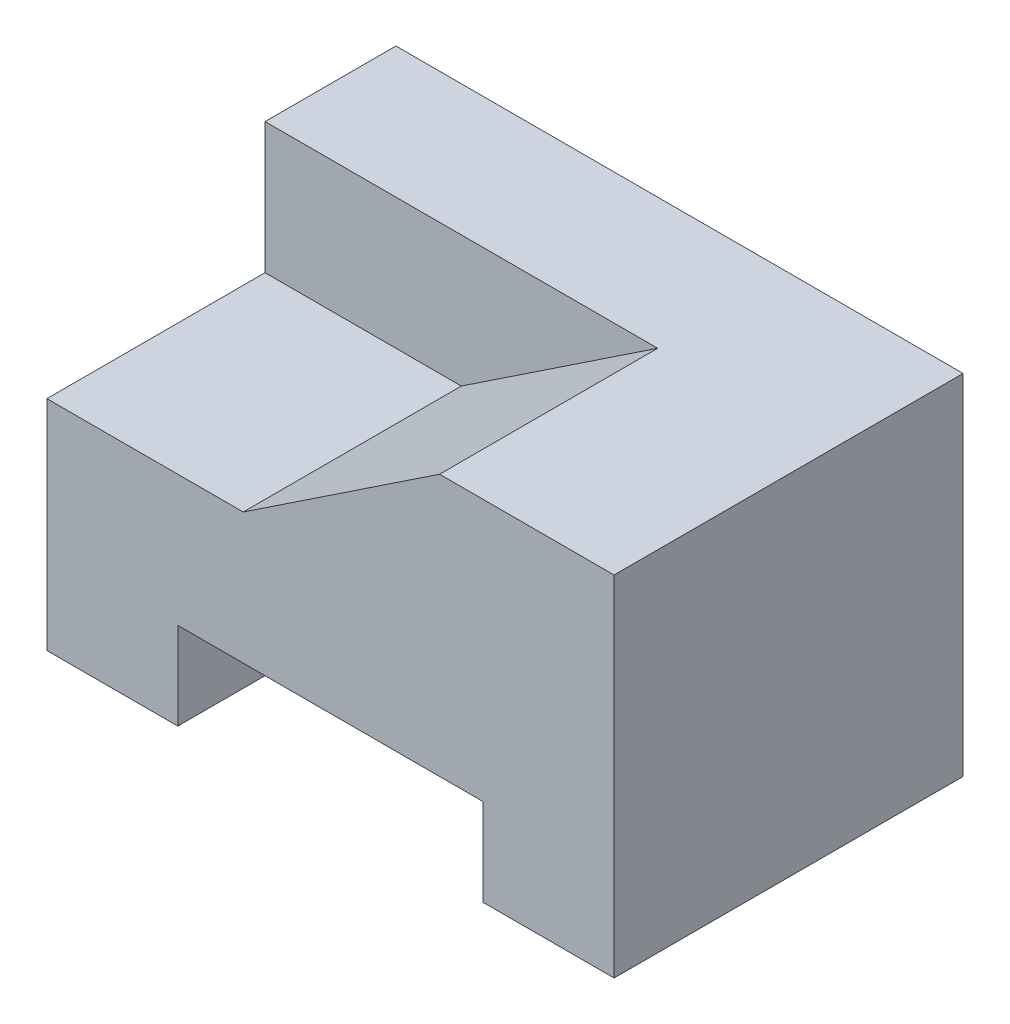
ISO-10303-21;
HEADER;
FILE_DESCRIPTION(('STEP AP214'),'2;1');
FILE_NAME('part.step','',(''),(''),'','','');
FILE_SCHEMA(('AUTOMOTIVE_DESIGN { 1 0 10303 214 1 1 1 1 }'));
ENDSEC;
DATA;
#1=APPLICATION_CONTEXT('core data for automotive mechanical design processes');
#2=APPLICATION_PROTOCOL_DEFINITION('international standard','automotive_design',2000,#1);
#3=PRODUCT_CONTEXT('',#1,'mechanical');
#4=PRODUCT('Part','Part','',(#3));
#5=PRODUCT_RELATED_PRODUCT_CATEGORY('part','',(#4));
#6=PRODUCT_DEFINITION_FORMATION('','',#4);
#7=PRODUCT_DEFINITION_CONTEXT('part definition',#1,'design');
#8=PRODUCT_DEFINITION('design','',#6,#7);
#9=PRODUCT_DEFINITION_SHAPE('','',#8);
#10=(LENGTH_UNIT() NAMED_UNIT(*) SI_UNIT(.MILLI.,.METRE.));
#11=(NAMED_UNIT(*) PLANE_ANGLE_UNIT() SI_UNIT($,.RADIAN.));
#12=(NAMED_UNIT(*) SI_UNIT($,.STERADIAN.) SOLID_ANGLE_UNIT());
#13=UNCERTAINTY_MEASURE_WITH_UNIT(LENGTH_MEASURE(1.E-05),#10,'distance_accuracy_value','');
#14=(GEOMETRIC_REPRESENTATION_CONTEXT(3) GLOBAL_UNCERTAINTY_ASSIGNED_CONTEXT((#13)) GLOBAL_UNIT_ASSIGNED_CONTEXT((#10,
#11,#12)) REPRESENTATION_CONTEXT('',''));
#15=CARTESIAN_POINT('',(0.,0.,0.));
#16=DIRECTION('',(0.,0.,1.));
#17=DIRECTION('',(1.,0.,0.));
#18=AXIS2_PLACEMENT_3D('',#15,#16,#17);
#19=CARTESIAN_POINT('',(10.,0.,8.));
#20=DIRECTION('',(-1.,0.,0.));
#21=DIRECTION('',(0.,0.,1.));
#22=AXIS2_PLACEMENT_3D('',#19,#20,#21);
#23=PLANE('',#22);
#24=DIRECTION('',(0.,1.,0.));
#25=VECTOR('',#24,1.);
#26=CARTESIAN_POINT('',(10.,0.,0.));
#27=LINE('',#26,#25);
#28=CARTESIAN_POINT('',(10.,0.,0.));
#29=VERTEX_POINT('',#28);
#30=CARTESIAN_POINT('',(10.,2.,0.));
#31=VERTEX_POINT('',#30);
#32=EDGE_CURVE('E139',#29,#31,#27,.T.);
#33=ORIENTED_EDGE('',*,*,#32,.F.);
#34=DIRECTION('',(0.,0.,-1.));
#35=VECTOR('',#34,1.);
#36=CARTESIAN_POINT('',(10.,0.,8.));
#37=LINE('',#36,#35);
#38=CARTESIAN_POINT('',(10.,0.,8.));
#39=VERTEX_POINT('',#38);
#40=EDGE_CURVE('E11',#39,#29,#37,.T.);
#41=ORIENTED_EDGE('',*,*,#40,.F.);
#42=DIRECTION('',(0.,1.,0.));
#43=VECTOR('',#42,1.);
#44=CARTESIAN_POINT('',(10.,0.,8.));
#45=LINE('',#44,#43);
#46=CARTESIAN_POINT('',(10.,2.,8.));
#47=VERTEX_POINT('',#46);
#48=EDGE_CURVE('E158',#39,#47,#45,.T.);
#49=ORIENTED_EDGE('',*,*,#48,.T.);
#50=DIRECTION('',(0.,0.,-1.));
#51=VECTOR('',#50,1.);
#52=CARTESIAN_POINT('',(10.,2.,8.));
#53=LINE('',#52,#51);
#54=EDGE_CURVE('E90',#47,#31,#53,.T.);
#55=ORIENTED_EDGE('',*,*,#54,.T.);
#56=EDGE_LOOP('',(#33,#41,#49,#55));
#57=FACE_BOUND('',#56,.T.);
#58=ADVANCED_FACE('F35',(#57),#23,.T.);
#59=CARTESIAN_POINT('',(0.,0.,8.));
#60=DIRECTION('',(0.,1.,0.));
#61=DIRECTION('',(0.,0.,1.));
#62=AXIS2_PLACEMENT_3D('',#59,#60,#61);
#63=PLANE('',#62);
#64=DIRECTION('',(1.,0.,0.));
#65=VECTOR('',#64,1.);
#66=CARTESIAN_POINT('',(0.,0.,0.));
#67=LINE('',#66,#65);
#68=CARTESIAN_POINT('',(13.,0.,0.));
#69=VERTEX_POINT('',#68);
#70=EDGE_CURVE('E142',#29,#69,#67,.T.);
#71=ORIENTED_EDGE('',*,*,#70,.T.);
#72=DIRECTION('',(0.,0.,-1.));
#73=VECTOR('',#72,1.);
#74=CARTESIAN_POINT('',(13.,0.,8.));
#75=LINE('',#74,#73);
#76=CARTESIAN_POINT('',(13.,0.,8.));
#77=VERTEX_POINT('',#76);
#78=EDGE_CURVE('E42',#77,#69,#75,.T.);
#79=ORIENTED_EDGE('',*,*,#78,.F.);
#80=DIRECTION('',(1.,0.,0.));
#81=VECTOR('',#80,1.);
#82=CARTESIAN_POINT('',(0.,0.,8.));
#83=LINE('',#82,#81);
#84=EDGE_CURVE('E121',#39,#77,#83,.T.);
#85=ORIENTED_EDGE('',*,*,#84,.F.);
#86=ORIENTED_EDGE('',*,*,#40,.T.);
#87=EDGE_LOOP('',(#71,#79,#85,#86));
#88=FACE_BOUND('',#87,.T.);
#89=ADVANCED_FACE('F240',(#88),#63,.F.);
#90=CARTESIAN_POINT('',(13.,0.,8.));
#91=DIRECTION('',(-1.,0.,0.));
#92=DIRECTION('',(0.,0.,1.));
#93=AXIS2_PLACEMENT_3D('',#90,#91,#92);
#94=PLANE('',#93);
#95=DIRECTION('',(0.,1.,0.));
#96=VECTOR('',#95,1.);
#97=CARTESIAN_POINT('',(13.,0.,0.));
#98=LINE('',#97,#96);
#99=CARTESIAN_POINT('',(13.,8.,0.));
#100=VERTEX_POINT('',#99);
#101=EDGE_CURVE('E145',#69,#100,#98,.T.);
#102=ORIENTED_EDGE('',*,*,#101,.T.);
#103=DIRECTION('',(0.,0.,-1.));
#104=VECTOR('',#103,1.);
#105=CARTESIAN_POINT('',(13.,8.,8.));
#106=LINE('',#105,#104);
#107=CARTESIAN_POINT('',(13.,8.,8.));
#108=VERTEX_POINT('',#107);
#109=EDGE_CURVE('E164',#108,#100,#106,.T.);
#110=ORIENTED_EDGE('',*,*,#109,.F.);
#111=DIRECTION('',(0.,1.,0.));
#112=VECTOR('',#111,1.);
#113=CARTESIAN_POINT('',(13.,0.,8.));
#114=LINE('',#113,#112);
#115=EDGE_CURVE('E173',#77,#108,#114,.T.);
#116=ORIENTED_EDGE('',*,*,#115,.F.);
#117=ORIENTED_EDGE('',*,*,#78,.T.);
#118=EDGE_LOOP('',(#102,#110,#116,#117));
#119=FACE_BOUND('',#118,.T.);
#120=ADVANCED_FACE('F170',(#119),#94,.F.);
#121=CARTESIAN_POINT('',(0.,8.,8.));
#122=DIRECTION('',(0.,1.,0.));
#123=DIRECTION('',(0.,0.,1.));
#124=AXIS2_PLACEMENT_3D('',#121,#122,#123);
#125=PLANE('',#124);
#126=DIRECTION('',(0.,0.,1.));
#127=VECTOR('',#126,1.);
#128=CARTESIAN_POINT('',(9.,8.,3.));
#129=LINE('',#128,#127);
#130=CARTESIAN_POINT('',(9.,8.,3.));
#131=VERTEX_POINT('',#130);
#132=CARTESIAN_POINT('',(9.,8.,8.));
#133=VERTEX_POINT('',#132);
#134=EDGE_CURVE('E143',#131,#133,#129,.T.);
#135=ORIENTED_EDGE('',*,*,#134,.T.);
#136=DIRECTION('',(1.,0.,0.));
#137=VECTOR('',#136,1.);
#138=CARTESIAN_POINT('',(0.,8.,8.));
#139=LINE('',#138,#137);
#140=EDGE_CURVE('E187',#133,#108,#139,.T.);
#141=ORIENTED_EDGE('',*,*,#140,.T.);
#142=ORIENTED_EDGE('',*,*,#109,.T.);
#143=DIRECTION('',(1.,0.,0.));
#144=VECTOR('',#143,1.);
#145=CARTESIAN_POINT('',(0.,8.,0.));
#146=LINE('',#145,#144);
#147=CARTESIAN_POINT('',(0.,8.,0.));
#148=VERTEX_POINT('',#147);
#149=EDGE_CURVE('E148',#148,#100,#146,.T.);
#150=ORIENTED_EDGE('',*,*,#149,.F.);
#151=DIRECTION('',(0.,0.,-1.));
#152=VECTOR('',#151,1.);
#153=CARTESIAN_POINT('',(0.,8.,8.));
#154=LINE('',#153,#152);
#155=CARTESIAN_POINT('',(0.,8.,3.));
#156=VERTEX_POINT('',#155);
#157=EDGE_CURVE('E162',#156,#148,#154,.T.);
#158=ORIENTED_EDGE('',*,*,#157,.F.);
#159=DIRECTION('',(-1.,0.,0.));
#160=VECTOR('',#159,1.);
#161=CARTESIAN_POINT('',(0.,8.,3.));
#162=LINE('',#161,#160);
#163=EDGE_CURVE('E201',#131,#156,#162,.T.);
#164=ORIENTED_EDGE('',*,*,#163,.F.);
#165=EDGE_LOOP('',(#135,#141,#142,#150,#158,#164));
#166=FACE_BOUND('',#165,.T.);
#167=ADVANCED_FACE('F183',(#166),#125,.T.);
#168=CARTESIAN_POINT('',(0.,0.,8.));
#169=DIRECTION('',(-1.,0.,0.));
#170=DIRECTION('',(0.,0.,1.));
#171=AXIS2_PLACEMENT_3D('',#168,#169,#170);
#172=PLANE('',#171);
#173=DIRECTION('',(0.,0.,1.));
#174=VECTOR('',#173,1.);
#175=CARTESIAN_POINT('',(0.,5.,3.));
#176=LINE('',#175,#174);
#177=CARTESIAN_POINT('',(0.,5.,3.));
#178=VERTEX_POINT('',#177);
#179=CARTESIAN_POINT('',(0.,5.,8.));
#180=VERTEX_POINT('',#179);
#181=EDGE_CURVE('E49',#178,#180,#176,.T.);
#182=ORIENTED_EDGE('',*,*,#181,.F.);
#183=DIRECTION('',(0.,-1.,0.));
#184=VECTOR('',#183,1.);
#185=CARTESIAN_POINT('',(0.,5.,3.));
#186=LINE('',#185,#184);
#187=EDGE_CURVE('E209',#156,#178,#186,.T.);
#188=ORIENTED_EDGE('',*,*,#187,.F.);
#189=ORIENTED_EDGE('',*,*,#157,.T.);
#190=DIRECTION('',(0.,1.,0.));
#191=VECTOR('',#190,1.);
#192=CARTESIAN_POINT('',(0.,0.,0.));
#193=LINE('',#192,#191);
#194=CARTESIAN_POINT('',(0.,0.,0.));
#195=VERTEX_POINT('',#194);
#196=EDGE_CURVE('E151',#195,#148,#193,.T.);
#197=ORIENTED_EDGE('',*,*,#196,.F.);
#198=DIRECTION('',(0.,0.,-1.));
#199=VECTOR('',#198,1.);
#200=CARTESIAN_POINT('',(0.,0.,8.));
#201=LINE('',#200,#199);
#202=CARTESIAN_POINT('',(0.,0.,8.));
#203=VERTEX_POINT('',#202);
#204=EDGE_CURVE('E129',#203,#195,#201,.T.);
#205=ORIENTED_EDGE('',*,*,#204,.F.);
#206=DIRECTION('',(0.,1.,0.));
#207=VECTOR('',#206,1.);
#208=CARTESIAN_POINT('',(0.,0.,8.));
#209=LINE('',#208,#207);
#210=EDGE_CURVE('E118',#203,#180,#209,.T.);
#211=ORIENTED_EDGE('',*,*,#210,.T.);
#212=EDGE_LOOP('',(#182,#188,#189,#197,#205,#211));
#213=FACE_BOUND('',#212,.T.);
#214=ADVANCED_FACE('F220',(#213),#172,.T.);
#215=CARTESIAN_POINT('',(3.,0.,0.));
#216=VERTEX_POINT('',#215);
#217=EDGE_CURVE('E126',#195,#216,#67,.T.);
#218=ORIENTED_EDGE('',*,*,#217,.T.);
#219=DIRECTION('',(0.,0.,-1.));
#220=VECTOR('',#219,1.);
#221=CARTESIAN_POINT('',(3.,0.,8.));
#222=LINE('',#221,#220);
#223=CARTESIAN_POINT('',(3.,0.,8.));
#224=VERTEX_POINT('',#223);
#225=EDGE_CURVE('E123',#224,#216,#222,.T.);
#226=ORIENTED_EDGE('',*,*,#225,.F.);
#227=EDGE_CURVE('E110',#203,#224,#83,.T.);
#228=ORIENTED_EDGE('',*,*,#227,.F.);
#229=ORIENTED_EDGE('',*,*,#204,.T.);
#230=EDGE_LOOP('',(#218,#226,#228,#229));
#231=FACE_BOUND('',#230,.T.);
#232=ADVANCED_FACE('F124',(#231),#63,.F.);
#233=CARTESIAN_POINT('',(3.,0.,8.));
#234=DIRECTION('',(-1.,0.,0.));
#235=DIRECTION('',(0.,0.,1.));
#236=AXIS2_PLACEMENT_3D('',#233,#234,#235);
#237=PLANE('',#236);
#238=DIRECTION('',(0.,1.,0.));
#239=VECTOR('',#238,1.);
#240=CARTESIAN_POINT('',(3.,0.,0.));
#241=LINE('',#240,#239);
#242=CARTESIAN_POINT('',(3.,2.,0.));
#243=VERTEX_POINT('',#242);
#244=EDGE_CURVE('E154',#216,#243,#241,.T.);
#245=ORIENTED_EDGE('',*,*,#244,.T.);
#246=DIRECTION('',(0.,0.,-1.));
#247=VECTOR('',#246,1.);
#248=CARTESIAN_POINT('',(3.,2.,8.));
#249=LINE('',#248,#247);
#250=CARTESIAN_POINT('',(3.,2.,8.));
#251=VERTEX_POINT('',#250);
#252=EDGE_CURVE('E130',#251,#243,#249,.T.);
#253=ORIENTED_EDGE('',*,*,#252,.F.);
#254=DIRECTION('',(0.,1.,0.));
#255=VECTOR('',#254,1.);
#256=CARTESIAN_POINT('',(3.,0.,8.));
#257=LINE('',#256,#255);
#258=EDGE_CURVE('E115',#224,#251,#257,.T.);
#259=ORIENTED_EDGE('',*,*,#258,.F.);
#260=ORIENTED_EDGE('',*,*,#225,.T.);
#261=EDGE_LOOP('',(#245,#253,#259,#260));
#262=FACE_BOUND('',#261,.T.);
#263=ADVANCED_FACE('F132',(#262),#237,.F.);
#264=CARTESIAN_POINT('',(0.,2.,8.));
#265=DIRECTION('',(0.,1.,0.));
#266=DIRECTION('',(0.,0.,1.));
#267=AXIS2_PLACEMENT_3D('',#264,#265,#266);
#268=PLANE('',#267);
#269=DIRECTION('',(1.,0.,0.));
#270=VECTOR('',#269,1.);
#271=CARTESIAN_POINT('',(0.,2.,0.));
#272=LINE('',#271,#270);
#273=EDGE_CURVE('E156',#243,#31,#272,.T.);
#274=ORIENTED_EDGE('',*,*,#273,.T.);
#275=ORIENTED_EDGE('',*,*,#54,.F.);
#276=DIRECTION('',(1.,0.,0.));
#277=VECTOR('',#276,1.);
#278=CARTESIAN_POINT('',(0.,2.,8.));
#279=LINE('',#278,#277);
#280=EDGE_CURVE('E58',#251,#47,#279,.T.);
#281=ORIENTED_EDGE('',*,*,#280,.F.);
#282=ORIENTED_EDGE('',*,*,#252,.T.);
#283=EDGE_LOOP('',(#274,#275,#281,#282));
#284=FACE_BOUND('',#283,.T.);
#285=ADVANCED_FACE('F247',(#284),#268,.F.);
#286=CARTESIAN_POINT('',(0.,0.,8.));
#287=DIRECTION('',(0.,0.,1.));
#288=DIRECTION('',(1.,0.,0.));
#289=AXIS2_PLACEMENT_3D('',#286,#287,#288);
#290=PLANE('',#289);
#291=DIRECTION('',(0.832050294337844,0.554700196225229,0.));
#292=VECTOR('',#291,1.);
#293=CARTESIAN_POINT('',(9.,8.,8.));
#294=LINE('',#293,#292);
#295=CARTESIAN_POINT('',(4.5,5.,8.));
#296=VERTEX_POINT('',#295);
#297=EDGE_CURVE('E198',#296,#133,#294,.T.);
#298=ORIENTED_EDGE('',*,*,#297,.F.);
#299=DIRECTION('',(1.,0.,0.));
#300=VECTOR('',#299,1.);
#301=CARTESIAN_POINT('',(4.5,5.,8.));
#302=LINE('',#301,#300);
#303=EDGE_CURVE('E202',#180,#296,#302,.T.);
#304=ORIENTED_EDGE('',*,*,#303,.F.);
#305=ORIENTED_EDGE('',*,*,#210,.F.);
#306=ORIENTED_EDGE('',*,*,#227,.T.);
#307=ORIENTED_EDGE('',*,*,#258,.T.);
#308=ORIENTED_EDGE('',*,*,#280,.T.);
#309=ORIENTED_EDGE('',*,*,#48,.F.);
#310=ORIENTED_EDGE('',*,*,#84,.T.);
#311=ORIENTED_EDGE('',*,*,#115,.T.);
#312=ORIENTED_EDGE('',*,*,#140,.F.);
#313=EDGE_LOOP('',(#298,#304,#305,#306,#307,#308,#309,#310,#311,#312));
#314=FACE_BOUND('',#313,.T.);
#315=ADVANCED_FACE('F113',(#314),#290,.T.);
#316=CARTESIAN_POINT('',(0.,0.,0.));
#317=DIRECTION('',(0.,0.,1.));
#318=DIRECTION('',(1.,0.,0.));
#319=AXIS2_PLACEMENT_3D('',#316,#317,#318);
#320=PLANE('',#319);
#321=ORIENTED_EDGE('',*,*,#32,.T.);
#322=ORIENTED_EDGE('',*,*,#273,.F.);
#323=ORIENTED_EDGE('',*,*,#244,.F.);
#324=ORIENTED_EDGE('',*,*,#217,.F.);
#325=ORIENTED_EDGE('',*,*,#196,.T.);
#326=ORIENTED_EDGE('',*,*,#149,.T.);
#327=ORIENTED_EDGE('',*,*,#101,.F.);
#328=ORIENTED_EDGE('',*,*,#70,.F.);
#329=EDGE_LOOP('',(#321,#322,#323,#324,#325,#326,#327,#328));
#330=FACE_BOUND('',#329,.T.);
#331=ADVANCED_FACE('F177',(#330),#320,.F.);
#332=CARTESIAN_POINT('',(9.,8.,3.));
#333=DIRECTION('',(0.554700196225229,-0.832050294337844,0.));
#334=DIRECTION('',(0.832050294337844,0.554700196225229,0.));
#335=AXIS2_PLACEMENT_3D('',#332,#333,#334);
#336=PLANE('',#335);
#337=ORIENTED_EDGE('',*,*,#297,.T.);
#338=ORIENTED_EDGE('',*,*,#134,.F.);
#339=DIRECTION('',(0.832050294337844,0.554700196225229,0.));
#340=VECTOR('',#339,1.);
#341=CARTESIAN_POINT('',(9.,8.,3.));
#342=LINE('',#341,#340);
#343=CARTESIAN_POINT('',(4.5,5.,3.));
#344=VERTEX_POINT('',#343);
#345=EDGE_CURVE('E194',#344,#131,#342,.T.);
#346=ORIENTED_EDGE('',*,*,#345,.F.);
#347=DIRECTION('',(0.,0.,1.));
#348=VECTOR('',#347,1.);
#349=CARTESIAN_POINT('',(4.5,5.,3.));
#350=LINE('',#349,#348);
#351=EDGE_CURVE('E193',#344,#296,#350,.T.);
#352=ORIENTED_EDGE('',*,*,#351,.T.);
#353=EDGE_LOOP('',(#337,#338,#346,#352));
#354=FACE_BOUND('',#353,.T.);
#355=ADVANCED_FACE('F228',(#354),#336,.F.);
#356=CARTESIAN_POINT('',(4.5,5.,3.));
#357=DIRECTION('',(0.,-1.,0.));
#358=DIRECTION('',(1.,0.,0.));
#359=AXIS2_PLACEMENT_3D('',#356,#357,#358);
#360=PLANE('',#359);
#361=ORIENTED_EDGE('',*,*,#303,.T.);
#362=ORIENTED_EDGE('',*,*,#351,.F.);
#363=DIRECTION('',(1.,0.,0.));
#364=VECTOR('',#363,1.);
#365=CARTESIAN_POINT('',(4.5,5.,3.));
#366=LINE('',#365,#364);
#367=EDGE_CURVE('E206',#178,#344,#366,.T.);
#368=ORIENTED_EDGE('',*,*,#367,.F.);
#369=ORIENTED_EDGE('',*,*,#181,.T.);
#370=EDGE_LOOP('',(#361,#362,#368,#369));
#371=FACE_BOUND('',#370,.T.);
#372=ADVANCED_FACE('F229',(#371),#360,.F.);
#373=CARTESIAN_POINT('',(0.,0.,3.));
#374=DIRECTION('',(0.,0.,1.));
#375=DIRECTION('',(1.,0.,0.));
#376=AXIS2_PLACEMENT_3D('',#373,#374,#375);
#377=PLANE('',#376);
#378=ORIENTED_EDGE('',*,*,#163,.T.);
#379=ORIENTED_EDGE('',*,*,#187,.T.);
#380=ORIENTED_EDGE('',*,*,#367,.T.);
#381=ORIENTED_EDGE('',*,*,#345,.T.);
#382=EDGE_LOOP('',(#378,#379,#380,#381));
#383=FACE_BOUND('',#382,.T.);
#384=ADVANCED_FACE('F215',(#383),#377,.T.);
#385=CLOSED_SHELL('',(#58,#89,#120,#167,#214,#232,#263,#285,#315,#331,#355,#372,#384));
#386=MANIFOLD_SOLID_BREP('B2',#385);
#387=ADVANCED_BREP_SHAPE_REPRESENTATION('',(#18,#386),#14);
#388=SHAPE_DEFINITION_REPRESENTATION(#9,#387);
ENDSEC;
END-ISO-10303-21;
